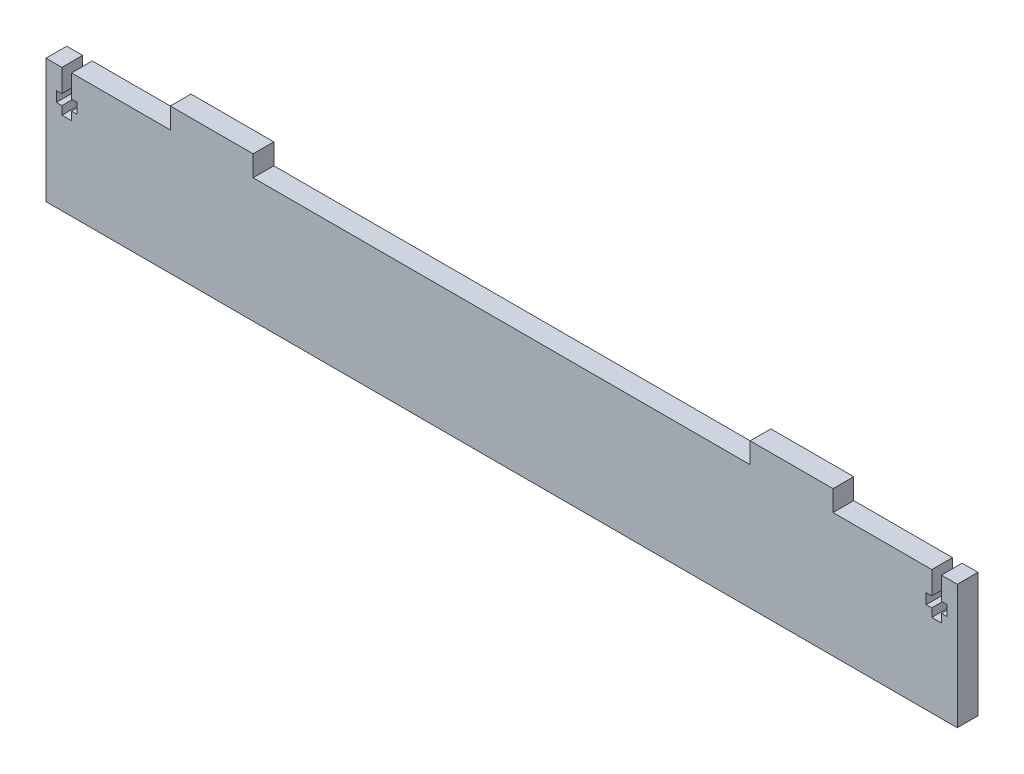
ISO-10303-21;
HEADER;
FILE_DESCRIPTION(('STEP AP214'),'2;1');
FILE_NAME('part.step','',(''),(''),'','','');
FILE_SCHEMA(('AUTOMOTIVE_DESIGN { 1 0 10303 214 1 1 1 1 }'));
ENDSEC;
DATA;
#1=APPLICATION_CONTEXT('core data for automotive mechanical design processes');
#2=APPLICATION_PROTOCOL_DEFINITION('international standard','automotive_design',2000,#1);
#3=PRODUCT_CONTEXT('',#1,'mechanical');
#4=PRODUCT('Part','Part','',(#3));
#5=PRODUCT_RELATED_PRODUCT_CATEGORY('part','',(#4));
#6=PRODUCT_DEFINITION_FORMATION('','',#4);
#7=PRODUCT_DEFINITION_CONTEXT('part definition',#1,'design');
#8=PRODUCT_DEFINITION('design','',#6,#7);
#9=PRODUCT_DEFINITION_SHAPE('','',#8);
#10=(LENGTH_UNIT() NAMED_UNIT(*) SI_UNIT(.MILLI.,.METRE.));
#11=(NAMED_UNIT(*) PLANE_ANGLE_UNIT() SI_UNIT($,.RADIAN.));
#12=(NAMED_UNIT(*) SI_UNIT($,.STERADIAN.) SOLID_ANGLE_UNIT());
#13=UNCERTAINTY_MEASURE_WITH_UNIT(LENGTH_MEASURE(1.E-05),#10,'distance_accuracy_value','');
#14=(GEOMETRIC_REPRESENTATION_CONTEXT(3) GLOBAL_UNCERTAINTY_ASSIGNED_CONTEXT((#13)) GLOBAL_UNIT_ASSIGNED_CONTEXT((#10,
#11,#12)) REPRESENTATION_CONTEXT('',''));
#15=CARTESIAN_POINT('',(0.,0.,0.));
#16=DIRECTION('',(0.,0.,1.));
#17=DIRECTION('',(1.,0.,0.));
#18=AXIS2_PLACEMENT_3D('',#15,#16,#17);
#19=CARTESIAN_POINT('',(101.6,19.05,6.35));
#20=DIRECTION('',(0.,-1.,0.));
#21=DIRECTION('',(1.,0.,0.));
#22=AXIS2_PLACEMENT_3D('',#19,#20,#21);
#23=PLANE('',#22);
#24=DIRECTION('',(-1.,0.,0.));
#25=VECTOR('',#24,1.);
#26=CARTESIAN_POINT('',(101.6,19.05,6.35));
#27=LINE('',#26,#25);
#28=CARTESIAN_POINT('',(131.8768,19.0499999999999,6.35));
#29=VERTEX_POINT('',#28);
#30=CARTESIAN_POINT('',(101.6,19.05,6.35));
#31=VERTEX_POINT('',#30);
#32=EDGE_CURVE('E508',#29,#31,#27,.T.);
#33=ORIENTED_EDGE('',*,*,#32,.F.);
#34=DIRECTION('',(0.,0.,1.));
#35=VECTOR('',#34,1.);
#36=CARTESIAN_POINT('',(131.8768,19.0499999999999,0.));
#37=LINE('',#36,#35);
#38=CARTESIAN_POINT('',(131.8768,19.0499999999999,0.));
#39=VERTEX_POINT('',#38);
#40=EDGE_CURVE('E484',#39,#29,#37,.T.);
#41=ORIENTED_EDGE('',*,*,#40,.F.);
#42=DIRECTION('',(-1.,0.,0.));
#43=VECTOR('',#42,1.);
#44=CARTESIAN_POINT('',(101.6,19.05,0.));
#45=LINE('',#44,#43);
#46=CARTESIAN_POINT('',(101.6,19.05,0.));
#47=VERTEX_POINT('',#46);
#48=EDGE_CURVE('E344',#39,#47,#45,.T.);
#49=ORIENTED_EDGE('',*,*,#48,.T.);
#50=DIRECTION('',(0.,0.,-1.));
#51=VECTOR('',#50,1.);
#52=CARTESIAN_POINT('',(101.6,19.05,6.35));
#53=LINE('',#52,#51);
#54=EDGE_CURVE('E40',#31,#47,#53,.T.);
#55=ORIENTED_EDGE('',*,*,#54,.F.);
#56=EDGE_LOOP('',(#33,#41,#49,#55));
#57=FACE_BOUND('',#56,.T.);
#58=ADVANCED_FACE('F32',(#57),#23,.F.);
#59=CARTESIAN_POINT('',(-139.7,19.05,6.35));
#60=DIRECTION('',(0.,-1.,0.));
#61=DIRECTION('',(0.,0.,-1.));
#62=AXIS2_PLACEMENT_3D('',#59,#60,#61);
#63=PLANE('',#62);
#64=DIRECTION('',(-1.,0.,0.));
#65=VECTOR('',#64,1.);
#66=CARTESIAN_POINT('',(-139.7,19.05,0.));
#67=LINE('',#66,#65);
#68=CARTESIAN_POINT('',(-101.6,19.05,0.));
#69=VERTEX_POINT('',#68);
#70=CARTESIAN_POINT('',(-131.8768,19.05,0.));
#71=VERTEX_POINT('',#70);
#72=EDGE_CURVE('E289',#69,#71,#67,.T.);
#73=ORIENTED_EDGE('',*,*,#72,.T.);
#74=DIRECTION('',(0.,0.,1.));
#75=VECTOR('',#74,1.);
#76=CARTESIAN_POINT('',(-131.8768,19.05,0.));
#77=LINE('',#76,#75);
#78=CARTESIAN_POINT('',(-131.8768,19.05,6.35));
#79=VERTEX_POINT('',#78);
#80=EDGE_CURVE('E379',#71,#79,#77,.T.);
#81=ORIENTED_EDGE('',*,*,#80,.T.);
#82=DIRECTION('',(-1.,0.,0.));
#83=VECTOR('',#82,1.);
#84=CARTESIAN_POINT('',(-139.7,19.05,6.35));
#85=LINE('',#84,#83);
#86=CARTESIAN_POINT('',(-101.6,19.05,6.35));
#87=VERTEX_POINT('',#86);
#88=EDGE_CURVE('E381',#87,#79,#85,.T.);
#89=ORIENTED_EDGE('',*,*,#88,.F.);
#90=DIRECTION('',(0.,0.,-1.));
#91=VECTOR('',#90,1.);
#92=CARTESIAN_POINT('',(-101.6,19.05,6.35));
#93=LINE('',#92,#91);
#94=EDGE_CURVE('E310',#87,#69,#93,.T.);
#95=ORIENTED_EDGE('',*,*,#94,.T.);
#96=EDGE_LOOP('',(#73,#81,#89,#95));
#97=FACE_BOUND('',#96,.T.);
#98=ADVANCED_FACE('F377',(#97),#63,.F.);
#99=CARTESIAN_POINT('',(139.7,19.05,6.35));
#100=DIRECTION('',(-1.,0.,0.));
#101=DIRECTION('',(0.,0.,1.));
#102=AXIS2_PLACEMENT_3D('',#99,#100,#101);
#103=PLANE('',#102);
#104=DIRECTION('',(0.,1.,0.));
#105=VECTOR('',#104,1.);
#106=CARTESIAN_POINT('',(139.7,19.05,0.));
#107=LINE('',#106,#105);
#108=CARTESIAN_POINT('',(139.7,-19.05,0.));
#109=VERTEX_POINT('',#108);
#110=CARTESIAN_POINT('',(139.7,19.05,0.));
#111=VERTEX_POINT('',#110);
#112=EDGE_CURVE('E390',#109,#111,#107,.T.);
#113=ORIENTED_EDGE('',*,*,#112,.T.);
#114=DIRECTION('',(0.,0.,-1.));
#115=VECTOR('',#114,1.);
#116=CARTESIAN_POINT('',(139.7,19.05,6.35));
#117=LINE('',#116,#115);
#118=CARTESIAN_POINT('',(139.7,19.05,6.35));
#119=VERTEX_POINT('',#118);
#120=EDGE_CURVE('E11',#119,#111,#117,.T.);
#121=ORIENTED_EDGE('',*,*,#120,.F.);
#122=DIRECTION('',(0.,1.,0.));
#123=VECTOR('',#122,1.);
#124=CARTESIAN_POINT('',(139.7,19.05,6.35));
#125=LINE('',#124,#123);
#126=CARTESIAN_POINT('',(139.7,-19.05,6.35));
#127=VERTEX_POINT('',#126);
#128=EDGE_CURVE('E300',#127,#119,#125,.T.);
#129=ORIENTED_EDGE('',*,*,#128,.F.);
#130=DIRECTION('',(0.,0.,-1.));
#131=VECTOR('',#130,1.);
#132=CARTESIAN_POINT('',(139.7,-19.05,6.35));
#133=LINE('',#132,#131);
#134=EDGE_CURVE('E301',#127,#109,#133,.T.);
#135=ORIENTED_EDGE('',*,*,#134,.T.);
#136=EDGE_LOOP('',(#113,#121,#129,#135));
#137=FACE_BOUND('',#136,.T.);
#138=ADVANCED_FACE('F34',(#137),#103,.F.);
#139=CARTESIAN_POINT('',(134.8232,19.0499999999999,0.));
#140=VERTEX_POINT('',#139);
#141=EDGE_CURVE('E347',#111,#140,#45,.T.);
#142=ORIENTED_EDGE('',*,*,#141,.T.);
#143=DIRECTION('',(0.,0.,1.));
#144=VECTOR('',#143,1.);
#145=CARTESIAN_POINT('',(134.8232,19.0499999999999,0.));
#146=LINE('',#145,#144);
#147=CARTESIAN_POINT('',(134.8232,19.0499999999999,6.35));
#148=VERTEX_POINT('',#147);
#149=EDGE_CURVE('E486',#140,#148,#146,.T.);
#150=ORIENTED_EDGE('',*,*,#149,.T.);
#151=EDGE_CURVE('E509',#119,#148,#27,.T.);
#152=ORIENTED_EDGE('',*,*,#151,.F.);
#153=ORIENTED_EDGE('',*,*,#120,.T.);
#154=EDGE_LOOP('',(#142,#150,#152,#153));
#155=FACE_BOUND('',#154,.T.);
#156=ADVANCED_FACE('F537',(#155),#23,.F.);
#157=CARTESIAN_POINT('',(101.6,19.05,6.35));
#158=DIRECTION('',(-1.,0.,0.));
#159=DIRECTION('',(0.,0.,1.));
#160=AXIS2_PLACEMENT_3D('',#157,#158,#159);
#161=PLANE('',#160);
#162=DIRECTION('',(0.,1.,0.));
#163=VECTOR('',#162,1.);
#164=CARTESIAN_POINT('',(101.6,19.05,0.));
#165=LINE('',#164,#163);
#166=CARTESIAN_POINT('',(101.6,25.4,0.));
#167=VERTEX_POINT('',#166);
#168=EDGE_CURVE('E337',#47,#167,#165,.T.);
#169=ORIENTED_EDGE('',*,*,#168,.T.);
#170=DIRECTION('',(0.,0.,-1.));
#171=VECTOR('',#170,1.);
#172=CARTESIAN_POINT('',(101.6,25.4,6.35));
#173=LINE('',#172,#171);
#174=CARTESIAN_POINT('',(101.6,25.4,6.35));
#175=VERTEX_POINT('',#174);
#176=EDGE_CURVE('E328',#175,#167,#173,.T.);
#177=ORIENTED_EDGE('',*,*,#176,.F.);
#178=DIRECTION('',(0.,1.,0.));
#179=VECTOR('',#178,1.);
#180=CARTESIAN_POINT('',(101.6,19.05,6.35));
#181=LINE('',#180,#179);
#182=EDGE_CURVE('E338',#31,#175,#181,.T.);
#183=ORIENTED_EDGE('',*,*,#182,.F.);
#184=ORIENTED_EDGE('',*,*,#54,.T.);
#185=EDGE_LOOP('',(#169,#177,#183,#184));
#186=FACE_BOUND('',#185,.T.);
#187=ADVANCED_FACE('F335',(#186),#161,.F.);
#188=CARTESIAN_POINT('',(101.6,25.4,6.35));
#189=DIRECTION('',(0.,-1.,0.));
#190=DIRECTION('',(1.,0.,0.));
#191=AXIS2_PLACEMENT_3D('',#188,#189,#190);
#192=PLANE('',#191);
#193=DIRECTION('',(-1.,0.,0.));
#194=VECTOR('',#193,1.);
#195=CARTESIAN_POINT('',(101.6,25.4,0.));
#196=LINE('',#195,#194);
#197=CARTESIAN_POINT('',(76.2,25.4,0.));
#198=VERTEX_POINT('',#197);
#199=EDGE_CURVE('E346',#167,#198,#196,.T.);
#200=ORIENTED_EDGE('',*,*,#199,.T.);
#201=DIRECTION('',(0.,0.,-1.));
#202=VECTOR('',#201,1.);
#203=CARTESIAN_POINT('',(76.2,25.4,6.35));
#204=LINE('',#203,#202);
#205=CARTESIAN_POINT('',(76.2,25.4,6.35));
#206=VERTEX_POINT('',#205);
#207=EDGE_CURVE('E325',#206,#198,#204,.T.);
#208=ORIENTED_EDGE('',*,*,#207,.F.);
#209=DIRECTION('',(-1.,0.,0.));
#210=VECTOR('',#209,1.);
#211=CARTESIAN_POINT('',(101.6,25.4,6.35));
#212=LINE('',#211,#210);
#213=EDGE_CURVE('E513',#175,#206,#212,.T.);
#214=ORIENTED_EDGE('',*,*,#213,.F.);
#215=ORIENTED_EDGE('',*,*,#176,.T.);
#216=EDGE_LOOP('',(#200,#208,#214,#215));
#217=FACE_BOUND('',#216,.T.);
#218=ADVANCED_FACE('F549',(#217),#192,.F.);
#219=CARTESIAN_POINT('',(76.2,25.4,6.35));
#220=DIRECTION('',(1.,0.,0.));
#221=DIRECTION('',(0.,0.,-1.));
#222=AXIS2_PLACEMENT_3D('',#219,#220,#221);
#223=PLANE('',#222);
#224=DIRECTION('',(0.,-1.,0.));
#225=VECTOR('',#224,1.);
#226=CARTESIAN_POINT('',(76.2,25.4,0.));
#227=LINE('',#226,#225);
#228=CARTESIAN_POINT('',(76.2,19.05,0.));
#229=VERTEX_POINT('',#228);
#230=EDGE_CURVE('E349',#198,#229,#227,.T.);
#231=ORIENTED_EDGE('',*,*,#230,.T.);
#232=DIRECTION('',(0.,0.,-1.));
#233=VECTOR('',#232,1.);
#234=CARTESIAN_POINT('',(76.2,19.05,6.35));
#235=LINE('',#234,#233);
#236=CARTESIAN_POINT('',(76.2,19.05,6.35));
#237=VERTEX_POINT('',#236);
#238=EDGE_CURVE('E322',#237,#229,#235,.T.);
#239=ORIENTED_EDGE('',*,*,#238,.F.);
#240=DIRECTION('',(0.,-1.,0.));
#241=VECTOR('',#240,1.);
#242=CARTESIAN_POINT('',(76.2,25.4,6.35));
#243=LINE('',#242,#241);
#244=EDGE_CURVE('E515',#206,#237,#243,.T.);
#245=ORIENTED_EDGE('',*,*,#244,.F.);
#246=ORIENTED_EDGE('',*,*,#207,.T.);
#247=EDGE_LOOP('',(#231,#239,#245,#246));
#248=FACE_BOUND('',#247,.T.);
#249=ADVANCED_FACE('F728',(#248),#223,.F.);
#250=CARTESIAN_POINT('',(-76.2,19.05,6.35));
#251=DIRECTION('',(0.,-1.,0.));
#252=DIRECTION('',(1.,0.,0.));
#253=AXIS2_PLACEMENT_3D('',#250,#251,#252);
#254=PLANE('',#253);
#255=DIRECTION('',(-1.,0.,0.));
#256=VECTOR('',#255,1.);
#257=CARTESIAN_POINT('',(-76.2,19.05,0.));
#258=LINE('',#257,#256);
#259=CARTESIAN_POINT('',(-76.2,19.05,0.));
#260=VERTEX_POINT('',#259);
#261=EDGE_CURVE('E356',#229,#260,#258,.T.);
#262=ORIENTED_EDGE('',*,*,#261,.T.);
#263=DIRECTION('',(0.,0.,-1.));
#264=VECTOR('',#263,1.);
#265=CARTESIAN_POINT('',(-76.2,19.05,6.35));
#266=LINE('',#265,#264);
#267=CARTESIAN_POINT('',(-76.2,19.05,6.35));
#268=VERTEX_POINT('',#267);
#269=EDGE_CURVE('E319',#268,#260,#266,.T.);
#270=ORIENTED_EDGE('',*,*,#269,.F.);
#271=DIRECTION('',(-1.,0.,0.));
#272=VECTOR('',#271,1.);
#273=CARTESIAN_POINT('',(-76.2,19.05,6.35));
#274=LINE('',#273,#272);
#275=EDGE_CURVE('E517',#237,#268,#274,.T.);
#276=ORIENTED_EDGE('',*,*,#275,.F.);
#277=ORIENTED_EDGE('',*,*,#238,.T.);
#278=EDGE_LOOP('',(#262,#270,#276,#277));
#279=FACE_BOUND('',#278,.T.);
#280=ADVANCED_FACE('F733',(#279),#254,.F.);
#281=CARTESIAN_POINT('',(-76.2,25.4,6.35));
#282=DIRECTION('',(-1.,0.,0.));
#283=DIRECTION('',(0.,0.,1.));
#284=AXIS2_PLACEMENT_3D('',#281,#282,#283);
#285=PLANE('',#284);
#286=DIRECTION('',(0.,1.,0.));
#287=VECTOR('',#286,1.);
#288=CARTESIAN_POINT('',(-76.2,25.4,0.));
#289=LINE('',#288,#287);
#290=CARTESIAN_POINT('',(-76.2,25.4,0.));
#291=VERTEX_POINT('',#290);
#292=EDGE_CURVE('E358',#260,#291,#289,.T.);
#293=ORIENTED_EDGE('',*,*,#292,.T.);
#294=DIRECTION('',(0.,0.,-1.));
#295=VECTOR('',#294,1.);
#296=CARTESIAN_POINT('',(-76.2,25.4,6.35));
#297=LINE('',#296,#295);
#298=CARTESIAN_POINT('',(-76.2,25.4,6.35));
#299=VERTEX_POINT('',#298);
#300=EDGE_CURVE('E316',#299,#291,#297,.T.);
#301=ORIENTED_EDGE('',*,*,#300,.F.);
#302=DIRECTION('',(0.,1.,0.));
#303=VECTOR('',#302,1.);
#304=CARTESIAN_POINT('',(-76.2,25.4,6.35));
#305=LINE('',#304,#303);
#306=EDGE_CURVE('E519',#268,#299,#305,.T.);
#307=ORIENTED_EDGE('',*,*,#306,.F.);
#308=ORIENTED_EDGE('',*,*,#269,.T.);
#309=EDGE_LOOP('',(#293,#301,#307,#308));
#310=FACE_BOUND('',#309,.T.);
#311=ADVANCED_FACE('F736',(#310),#285,.F.);
#312=CARTESIAN_POINT('',(-101.6,25.4,6.35));
#313=DIRECTION('',(0.,-1.,0.));
#314=DIRECTION('',(1.,0.,0.));
#315=AXIS2_PLACEMENT_3D('',#312,#313,#314);
#316=PLANE('',#315);
#317=DIRECTION('',(-1.,0.,0.));
#318=VECTOR('',#317,1.);
#319=CARTESIAN_POINT('',(-101.6,25.4,0.));
#320=LINE('',#319,#318);
#321=CARTESIAN_POINT('',(-101.6,25.4,0.));
#322=VERTEX_POINT('',#321);
#323=EDGE_CURVE('E293',#291,#322,#320,.T.);
#324=ORIENTED_EDGE('',*,*,#323,.T.);
#325=DIRECTION('',(0.,0.,-1.));
#326=VECTOR('',#325,1.);
#327=CARTESIAN_POINT('',(-101.6,25.4,6.35));
#328=LINE('',#327,#326);
#329=CARTESIAN_POINT('',(-101.6,25.4,6.35));
#330=VERTEX_POINT('',#329);
#331=EDGE_CURVE('E313',#330,#322,#328,.T.);
#332=ORIENTED_EDGE('',*,*,#331,.F.);
#333=DIRECTION('',(-1.,0.,0.));
#334=VECTOR('',#333,1.);
#335=CARTESIAN_POINT('',(-101.6,25.4,6.35));
#336=LINE('',#335,#334);
#337=EDGE_CURVE('E520',#299,#330,#336,.T.);
#338=ORIENTED_EDGE('',*,*,#337,.F.);
#339=ORIENTED_EDGE('',*,*,#300,.T.);
#340=EDGE_LOOP('',(#324,#332,#338,#339));
#341=FACE_BOUND('',#340,.T.);
#342=ADVANCED_FACE('F362',(#341),#316,.F.);
#343=CARTESIAN_POINT('',(-101.6,19.05,6.35));
#344=DIRECTION('',(1.,0.,0.));
#345=DIRECTION('',(0.,0.,-1.));
#346=AXIS2_PLACEMENT_3D('',#343,#344,#345);
#347=PLANE('',#346);
#348=DIRECTION('',(0.,-1.,0.));
#349=VECTOR('',#348,1.);
#350=CARTESIAN_POINT('',(-101.6,19.05,0.));
#351=LINE('',#350,#349);
#352=EDGE_CURVE('E290',#322,#69,#351,.T.);
#353=ORIENTED_EDGE('',*,*,#352,.T.);
#354=ORIENTED_EDGE('',*,*,#94,.F.);
#355=DIRECTION('',(0.,-1.,0.));
#356=VECTOR('',#355,1.);
#357=CARTESIAN_POINT('',(-101.6,19.05,6.35));
#358=LINE('',#357,#356);
#359=EDGE_CURVE('E371',#330,#87,#358,.T.);
#360=ORIENTED_EDGE('',*,*,#359,.F.);
#361=ORIENTED_EDGE('',*,*,#331,.T.);
#362=EDGE_LOOP('',(#353,#354,#360,#361));
#363=FACE_BOUND('',#362,.T.);
#364=ADVANCED_FACE('F369',(#363),#347,.F.);
#365=CARTESIAN_POINT('',(-134.8232,19.05,6.35));
#366=VERTEX_POINT('',#365);
#367=CARTESIAN_POINT('',(-139.7,19.05,6.35));
#368=VERTEX_POINT('',#367);
#369=EDGE_CURVE('E281',#366,#368,#85,.T.);
#370=ORIENTED_EDGE('',*,*,#369,.F.);
#371=DIRECTION('',(0.,0.,1.));
#372=VECTOR('',#371,1.);
#373=CARTESIAN_POINT('',(-134.8232,19.05,0.));
#374=LINE('',#373,#372);
#375=CARTESIAN_POINT('',(-134.8232,19.05,0.));
#376=VERTEX_POINT('',#375);
#377=EDGE_CURVE('E268',#376,#366,#374,.T.);
#378=ORIENTED_EDGE('',*,*,#377,.F.);
#379=CARTESIAN_POINT('',(-139.7,19.05,0.));
#380=VERTEX_POINT('',#379);
#381=EDGE_CURVE('E279',#376,#380,#67,.T.);
#382=ORIENTED_EDGE('',*,*,#381,.T.);
#383=DIRECTION('',(0.,0.,-1.));
#384=VECTOR('',#383,1.);
#385=CARTESIAN_POINT('',(-139.7,19.05,6.35));
#386=LINE('',#385,#384);
#387=EDGE_CURVE('E308',#368,#380,#386,.T.);
#388=ORIENTED_EDGE('',*,*,#387,.F.);
#389=EDGE_LOOP('',(#370,#378,#382,#388));
#390=FACE_BOUND('',#389,.T.);
#391=ADVANCED_FACE('F277',(#390),#63,.F.);
#392=CARTESIAN_POINT('',(-139.7,19.05,6.35));
#393=DIRECTION('',(1.,0.,0.));
#394=DIRECTION('',(0.,0.,-1.));
#395=AXIS2_PLACEMENT_3D('',#392,#393,#394);
#396=PLANE('',#395);
#397=DIRECTION('',(0.,-1.,0.));
#398=VECTOR('',#397,1.);
#399=CARTESIAN_POINT('',(-139.7,19.05,0.));
#400=LINE('',#399,#398);
#401=CARTESIAN_POINT('',(-139.7,-19.05,0.));
#402=VERTEX_POINT('',#401);
#403=EDGE_CURVE('E288',#380,#402,#400,.T.);
#404=ORIENTED_EDGE('',*,*,#403,.T.);
#405=DIRECTION('',(0.,0.,-1.));
#406=VECTOR('',#405,1.);
#407=CARTESIAN_POINT('',(-139.7,-19.05,6.35));
#408=LINE('',#407,#406);
#409=CARTESIAN_POINT('',(-139.7,-19.05,6.35));
#410=VERTEX_POINT('',#409);
#411=EDGE_CURVE('E304',#410,#402,#408,.T.);
#412=ORIENTED_EDGE('',*,*,#411,.F.);
#413=DIRECTION('',(0.,-1.,0.));
#414=VECTOR('',#413,1.);
#415=CARTESIAN_POINT('',(-139.7,19.05,6.35));
#416=LINE('',#415,#414);
#417=EDGE_CURVE('E384',#368,#410,#416,.T.);
#418=ORIENTED_EDGE('',*,*,#417,.F.);
#419=ORIENTED_EDGE('',*,*,#387,.T.);
#420=EDGE_LOOP('',(#404,#412,#418,#419));
#421=FACE_BOUND('',#420,.T.);
#422=ADVANCED_FACE('F532',(#421),#396,.F.);
#423=CARTESIAN_POINT('',(-139.7,-19.05,6.35));
#424=DIRECTION('',(0.,1.,0.));
#425=DIRECTION('',(0.,0.,1.));
#426=AXIS2_PLACEMENT_3D('',#423,#424,#425);
#427=PLANE('',#426);
#428=DIRECTION('',(1.,0.,0.));
#429=VECTOR('',#428,1.);
#430=CARTESIAN_POINT('',(-139.7,-19.05,0.));
#431=LINE('',#430,#429);
#432=EDGE_CURVE('E298',#402,#109,#431,.T.);
#433=ORIENTED_EDGE('',*,*,#432,.T.);
#434=ORIENTED_EDGE('',*,*,#134,.F.);
#435=DIRECTION('',(1.,0.,0.));
#436=VECTOR('',#435,1.);
#437=CARTESIAN_POINT('',(-139.7,-19.05,6.35));
#438=LINE('',#437,#436);
#439=EDGE_CURVE('E305',#410,#127,#438,.T.);
#440=ORIENTED_EDGE('',*,*,#439,.F.);
#441=ORIENTED_EDGE('',*,*,#411,.T.);
#442=EDGE_LOOP('',(#433,#434,#440,#441));
#443=FACE_BOUND('',#442,.T.);
#444=ADVANCED_FACE('F524',(#443),#427,.F.);
#445=CARTESIAN_POINT('',(0.,0.,6.35));
#446=DIRECTION('',(0.,0.,1.));
#447=DIRECTION('',(1.,0.,0.));
#448=AXIS2_PLACEMENT_3D('',#445,#446,#447);
#449=PLANE('',#448);
#450=DIRECTION('',(0.,1.,0.));
#451=VECTOR('',#450,1.);
#452=CARTESIAN_POINT('',(-131.8768,12.065,6.35));
#453=LINE('',#452,#451);
#454=CARTESIAN_POINT('',(-131.8768,12.065,6.35));
#455=VERTEX_POINT('',#454);
#456=EDGE_CURVE('E273',#455,#79,#453,.T.);
#457=ORIENTED_EDGE('',*,*,#456,.F.);
#458=DIRECTION('',(-1.,0.,0.));
#459=VECTOR('',#458,1.);
#460=CARTESIAN_POINT('',(-130.175,12.065,6.35));
#461=LINE('',#460,#459);
#462=CARTESIAN_POINT('',(-130.175,12.065,6.35));
#463=VERTEX_POINT('',#462);
#464=EDGE_CURVE('E592',#463,#455,#461,.T.);
#465=ORIENTED_EDGE('',*,*,#464,.F.);
#466=DIRECTION('',(0.,1.,0.));
#467=VECTOR('',#466,1.);
#468=CARTESIAN_POINT('',(-130.175,8.89000000000001,6.35));
#469=LINE('',#468,#467);
#470=CARTESIAN_POINT('',(-130.175,8.89000000000001,6.35));
#471=VERTEX_POINT('',#470);
#472=EDGE_CURVE('E590',#471,#463,#469,.T.);
#473=ORIENTED_EDGE('',*,*,#472,.F.);
#474=DIRECTION('',(1.,0.,0.));
#475=VECTOR('',#474,1.);
#476=CARTESIAN_POINT('',(-131.8768,8.89000000000001,6.35));
#477=LINE('',#476,#475);
#478=CARTESIAN_POINT('',(-131.8768,8.89000000000001,6.35));
#479=VERTEX_POINT('',#478);
#480=EDGE_CURVE('E587',#479,#471,#477,.T.);
#481=ORIENTED_EDGE('',*,*,#480,.F.);
#482=DIRECTION('',(0.,1.,0.));
#483=VECTOR('',#482,1.);
#484=CARTESIAN_POINT('',(-131.8768,6.35,6.35));
#485=LINE('',#484,#483);
#486=CARTESIAN_POINT('',(-131.8768,6.35,6.35));
#487=VERTEX_POINT('',#486);
#488=EDGE_CURVE('E584',#487,#479,#485,.T.);
#489=ORIENTED_EDGE('',*,*,#488,.F.);
#490=DIRECTION('',(1.,0.,0.));
#491=VECTOR('',#490,1.);
#492=CARTESIAN_POINT('',(-134.8232,6.35,6.35));
#493=LINE('',#492,#491);
#494=CARTESIAN_POINT('',(-134.8232,6.35,6.35));
#495=VERTEX_POINT('',#494);
#496=EDGE_CURVE('E581',#495,#487,#493,.T.);
#497=ORIENTED_EDGE('',*,*,#496,.F.);
#498=DIRECTION('',(0.,-1.,0.));
#499=VECTOR('',#498,1.);
#500=CARTESIAN_POINT('',(-134.8232,8.89000000000001,6.35));
#501=LINE('',#500,#499);
#502=CARTESIAN_POINT('',(-134.8232,8.89000000000001,6.35));
#503=VERTEX_POINT('',#502);
#504=EDGE_CURVE('E578',#503,#495,#501,.T.);
#505=ORIENTED_EDGE('',*,*,#504,.F.);
#506=DIRECTION('',(1.,0.,0.));
#507=VECTOR('',#506,1.);
#508=CARTESIAN_POINT('',(-136.525,8.89000000000001,6.35));
#509=LINE('',#508,#507);
#510=CARTESIAN_POINT('',(-136.525,8.89000000000001,6.35));
#511=VERTEX_POINT('',#510);
#512=EDGE_CURVE('E575',#511,#503,#509,.T.);
#513=ORIENTED_EDGE('',*,*,#512,.F.);
#514=DIRECTION('',(0.,-1.,0.));
#515=VECTOR('',#514,1.);
#516=CARTESIAN_POINT('',(-136.525,12.065,6.35));
#517=LINE('',#516,#515);
#518=CARTESIAN_POINT('',(-136.525,12.065,6.35));
#519=VERTEX_POINT('',#518);
#520=EDGE_CURVE('E568',#519,#511,#517,.T.);
#521=ORIENTED_EDGE('',*,*,#520,.F.);
#522=DIRECTION('',(-1.,0.,0.));
#523=VECTOR('',#522,1.);
#524=CARTESIAN_POINT('',(-134.8232,12.065,6.35));
#525=LINE('',#524,#523);
#526=CARTESIAN_POINT('',(-134.8232,12.065,6.35));
#527=VERTEX_POINT('',#526);
#528=EDGE_CURVE('E566',#527,#519,#525,.T.);
#529=ORIENTED_EDGE('',*,*,#528,.F.);
#530=DIRECTION('',(0.,-1.,0.));
#531=VECTOR('',#530,1.);
#532=CARTESIAN_POINT('',(-134.8232,19.05,6.35));
#533=LINE('',#532,#531);
#534=EDGE_CURVE('E483',#366,#527,#533,.T.);
#535=ORIENTED_EDGE('',*,*,#534,.F.);
#536=ORIENTED_EDGE('',*,*,#369,.T.);
#537=ORIENTED_EDGE('',*,*,#417,.T.);
#538=ORIENTED_EDGE('',*,*,#439,.T.);
#539=ORIENTED_EDGE('',*,*,#128,.T.);
#540=ORIENTED_EDGE('',*,*,#151,.T.);
#541=DIRECTION('',(0.,1.,0.));
#542=VECTOR('',#541,1.);
#543=CARTESIAN_POINT('',(134.8232,19.0499999999999,6.35));
#544=LINE('',#543,#542);
#545=CARTESIAN_POINT('',(134.8232,12.0649999999999,6.35));
#546=VERTEX_POINT('',#545);
#547=EDGE_CURVE('E477',#546,#148,#544,.T.);
#548=ORIENTED_EDGE('',*,*,#547,.F.);
#549=DIRECTION('',(-1.,0.,0.));
#550=VECTOR('',#549,1.);
#551=CARTESIAN_POINT('',(134.8232,12.0649999999999,6.35));
#552=LINE('',#551,#550);
#553=CARTESIAN_POINT('',(136.525,12.0649999999999,6.35));
#554=VERTEX_POINT('',#553);
#555=EDGE_CURVE('E474',#554,#546,#552,.T.);
#556=ORIENTED_EDGE('',*,*,#555,.F.);
#557=DIRECTION('',(0.,1.,0.));
#558=VECTOR('',#557,1.);
#559=CARTESIAN_POINT('',(136.525,12.0649999999999,6.35));
#560=LINE('',#559,#558);
#561=CARTESIAN_POINT('',(136.525,8.88999999999989,6.35));
#562=VERTEX_POINT('',#561);
#563=EDGE_CURVE('E471',#562,#554,#560,.T.);
#564=ORIENTED_EDGE('',*,*,#563,.F.);
#565=DIRECTION('',(1.,0.,0.));
#566=VECTOR('',#565,1.);
#567=CARTESIAN_POINT('',(136.525,8.88999999999989,6.35));
#568=LINE('',#567,#566);
#569=CARTESIAN_POINT('',(134.8232,8.88999999999989,6.35));
#570=VERTEX_POINT('',#569);
#571=EDGE_CURVE('E468',#570,#562,#568,.T.);
#572=ORIENTED_EDGE('',*,*,#571,.F.);
#573=DIRECTION('',(0.,1.,0.));
#574=VECTOR('',#573,1.);
#575=CARTESIAN_POINT('',(134.8232,8.88999999999989,6.35));
#576=LINE('',#575,#574);
#577=CARTESIAN_POINT('',(134.8232,6.34999999999989,6.35));
#578=VERTEX_POINT('',#577);
#579=EDGE_CURVE('E465',#578,#570,#576,.T.);
#580=ORIENTED_EDGE('',*,*,#579,.F.);
#581=DIRECTION('',(1.,0.,0.));
#582=VECTOR('',#581,1.);
#583=CARTESIAN_POINT('',(134.8232,6.34999999999989,6.35));
#584=LINE('',#583,#582);
#585=CARTESIAN_POINT('',(131.8768,6.34999999999989,6.35));
#586=VERTEX_POINT('',#585);
#587=EDGE_CURVE('E462',#586,#578,#584,.T.);
#588=ORIENTED_EDGE('',*,*,#587,.F.);
#589=DIRECTION('',(0.,-1.,0.));
#590=VECTOR('',#589,1.);
#591=CARTESIAN_POINT('',(131.8768,6.34999999999989,6.35));
#592=LINE('',#591,#590);
#593=CARTESIAN_POINT('',(131.8768,8.88999999999989,6.35));
#594=VERTEX_POINT('',#593);
#595=EDGE_CURVE('E459',#594,#586,#592,.T.);
#596=ORIENTED_EDGE('',*,*,#595,.F.);
#597=DIRECTION('',(1.,0.,0.));
#598=VECTOR('',#597,1.);
#599=CARTESIAN_POINT('',(131.8768,8.88999999999989,6.35));
#600=LINE('',#599,#598);
#601=CARTESIAN_POINT('',(130.175,8.88999999999989,6.35));
#602=VERTEX_POINT('',#601);
#603=EDGE_CURVE('E456',#602,#594,#600,.T.);
#604=ORIENTED_EDGE('',*,*,#603,.F.);
#605=DIRECTION('',(0.,-1.,0.));
#606=VECTOR('',#605,1.);
#607=CARTESIAN_POINT('',(130.175,8.88999999999989,6.35));
#608=LINE('',#607,#606);
#609=CARTESIAN_POINT('',(130.175,12.0649999999999,6.35));
#610=VERTEX_POINT('',#609);
#611=EDGE_CURVE('E453',#610,#602,#608,.T.);
#612=ORIENTED_EDGE('',*,*,#611,.F.);
#613=DIRECTION('',(-1.,0.,0.));
#614=VECTOR('',#613,1.);
#615=CARTESIAN_POINT('',(130.175,12.0649999999999,6.35));
#616=LINE('',#615,#614);
#617=CARTESIAN_POINT('',(131.8768,12.0649999999999,6.35));
#618=VERTEX_POINT('',#617);
#619=EDGE_CURVE('E450',#618,#610,#616,.T.);
#620=ORIENTED_EDGE('',*,*,#619,.F.);
#621=DIRECTION('',(0.,-1.,0.));
#622=VECTOR('',#621,1.);
#623=CARTESIAN_POINT('',(131.8768,12.0649999999999,6.35));
#624=LINE('',#623,#622);
#625=EDGE_CURVE('E422',#29,#618,#624,.T.);
#626=ORIENTED_EDGE('',*,*,#625,.F.);
#627=ORIENTED_EDGE('',*,*,#32,.T.);
#628=ORIENTED_EDGE('',*,*,#182,.T.);
#629=ORIENTED_EDGE('',*,*,#213,.T.);
#630=ORIENTED_EDGE('',*,*,#244,.T.);
#631=ORIENTED_EDGE('',*,*,#275,.T.);
#632=ORIENTED_EDGE('',*,*,#306,.T.);
#633=ORIENTED_EDGE('',*,*,#337,.T.);
#634=ORIENTED_EDGE('',*,*,#359,.T.);
#635=ORIENTED_EDGE('',*,*,#88,.T.);
#636=EDGE_LOOP('',(#457,#465,#473,#481,#489,#497,#505,#513,#521,#529,#535,#536,#537,#538,#539,
#540,#548,#556,#564,#572,#580,#588,#596,#604,#612,#620,#626,#627,#628,#629,#630,#631,#632,#633,
#634,#635));
#637=FACE_BOUND('',#636,.T.);
#638=ADVANCED_FACE('F521',(#637),#449,.T.);
#639=CARTESIAN_POINT('',(0.,0.,0.));
#640=DIRECTION('',(0.,0.,1.));
#641=DIRECTION('',(1.,0.,0.));
#642=AXIS2_PLACEMENT_3D('',#639,#640,#641);
#643=PLANE('',#642);
#644=DIRECTION('',(-1.,0.,0.));
#645=VECTOR('',#644,1.);
#646=CARTESIAN_POINT('',(-130.175,12.065,0.));
#647=LINE('',#646,#645);
#648=CARTESIAN_POINT('',(-130.175,12.065,0.));
#649=VERTEX_POINT('',#648);
#650=CARTESIAN_POINT('',(-131.8768,12.065,0.));
#651=VERTEX_POINT('',#650);
#652=EDGE_CURVE('E599',#649,#651,#647,.T.);
#653=ORIENTED_EDGE('',*,*,#652,.T.);
#654=DIRECTION('',(0.,1.,0.));
#655=VECTOR('',#654,1.);
#656=CARTESIAN_POINT('',(-131.8768,12.065,0.));
#657=LINE('',#656,#655);
#658=EDGE_CURVE('E282',#651,#71,#657,.T.);
#659=ORIENTED_EDGE('',*,*,#658,.T.);
#660=ORIENTED_EDGE('',*,*,#72,.F.);
#661=ORIENTED_EDGE('',*,*,#352,.F.);
#662=ORIENTED_EDGE('',*,*,#323,.F.);
#663=ORIENTED_EDGE('',*,*,#292,.F.);
#664=ORIENTED_EDGE('',*,*,#261,.F.);
#665=ORIENTED_EDGE('',*,*,#230,.F.);
#666=ORIENTED_EDGE('',*,*,#199,.F.);
#667=ORIENTED_EDGE('',*,*,#168,.F.);
#668=ORIENTED_EDGE('',*,*,#48,.F.);
#669=DIRECTION('',(0.,-1.,0.));
#670=VECTOR('',#669,1.);
#671=CARTESIAN_POINT('',(131.8768,12.0649999999999,0.));
#672=LINE('',#671,#670);
#673=CARTESIAN_POINT('',(131.8768,12.0649999999999,0.));
#674=VERTEX_POINT('',#673);
#675=EDGE_CURVE('E447',#39,#674,#672,.T.);
#676=ORIENTED_EDGE('',*,*,#675,.T.);
#677=DIRECTION('',(-1.,0.,0.));
#678=VECTOR('',#677,1.);
#679=CARTESIAN_POINT('',(130.175,12.0649999999999,0.));
#680=LINE('',#679,#678);
#681=CARTESIAN_POINT('',(130.175,12.0649999999999,0.));
#682=VERTEX_POINT('',#681);
#683=EDGE_CURVE('E418',#674,#682,#680,.T.);
#684=ORIENTED_EDGE('',*,*,#683,.T.);
#685=DIRECTION('',(0.,-1.,0.));
#686=VECTOR('',#685,1.);
#687=CARTESIAN_POINT('',(130.175,8.88999999999989,0.));
#688=LINE('',#687,#686);
#689=CARTESIAN_POINT('',(130.175,8.88999999999989,0.));
#690=VERTEX_POINT('',#689);
#691=EDGE_CURVE('E421',#682,#690,#688,.T.);
#692=ORIENTED_EDGE('',*,*,#691,.T.);
#693=DIRECTION('',(1.,0.,0.));
#694=VECTOR('',#693,1.);
#695=CARTESIAN_POINT('',(131.8768,8.88999999999989,0.));
#696=LINE('',#695,#694);
#697=CARTESIAN_POINT('',(131.8768,8.88999999999989,0.));
#698=VERTEX_POINT('',#697);
#699=EDGE_CURVE('E55',#690,#698,#696,.T.);
#700=ORIENTED_EDGE('',*,*,#699,.T.);
#701=DIRECTION('',(0.,-1.,0.));
#702=VECTOR('',#701,1.);
#703=CARTESIAN_POINT('',(131.8768,6.34999999999989,0.));
#704=LINE('',#703,#702);
#705=CARTESIAN_POINT('',(131.8768,6.34999999999989,0.));
#706=VERTEX_POINT('',#705);
#707=EDGE_CURVE('E426',#698,#706,#704,.T.);
#708=ORIENTED_EDGE('',*,*,#707,.T.);
#709=DIRECTION('',(1.,0.,0.));
#710=VECTOR('',#709,1.);
#711=CARTESIAN_POINT('',(134.8232,6.34999999999989,0.));
#712=LINE('',#711,#710);
#713=CARTESIAN_POINT('',(134.8232,6.34999999999989,0.));
#714=VERTEX_POINT('',#713);
#715=EDGE_CURVE('E429',#706,#714,#712,.T.);
#716=ORIENTED_EDGE('',*,*,#715,.T.);
#717=DIRECTION('',(0.,1.,0.));
#718=VECTOR('',#717,1.);
#719=CARTESIAN_POINT('',(134.8232,8.88999999999989,0.));
#720=LINE('',#719,#718);
#721=CARTESIAN_POINT('',(134.8232,8.88999999999989,0.));
#722=VERTEX_POINT('',#721);
#723=EDGE_CURVE('E432',#714,#722,#720,.T.);
#724=ORIENTED_EDGE('',*,*,#723,.T.);
#725=DIRECTION('',(1.,0.,0.));
#726=VECTOR('',#725,1.);
#727=CARTESIAN_POINT('',(136.525,8.88999999999989,0.));
#728=LINE('',#727,#726);
#729=CARTESIAN_POINT('',(136.525,8.88999999999989,0.));
#730=VERTEX_POINT('',#729);
#731=EDGE_CURVE('E435',#722,#730,#728,.T.);
#732=ORIENTED_EDGE('',*,*,#731,.T.);
#733=DIRECTION('',(0.,1.,0.));
#734=VECTOR('',#733,1.);
#735=CARTESIAN_POINT('',(136.525,12.0649999999999,0.));
#736=LINE('',#735,#734);
#737=CARTESIAN_POINT('',(136.525,12.0649999999999,0.));
#738=VERTEX_POINT('',#737);
#739=EDGE_CURVE('E438',#730,#738,#736,.T.);
#740=ORIENTED_EDGE('',*,*,#739,.T.);
#741=DIRECTION('',(-1.,0.,0.));
#742=VECTOR('',#741,1.);
#743=CARTESIAN_POINT('',(134.8232,12.0649999999999,0.));
#744=LINE('',#743,#742);
#745=CARTESIAN_POINT('',(134.8232,12.0649999999999,0.));
#746=VERTEX_POINT('',#745);
#747=EDGE_CURVE('E441',#738,#746,#744,.T.);
#748=ORIENTED_EDGE('',*,*,#747,.T.);
#749=DIRECTION('',(0.,1.,0.));
#750=VECTOR('',#749,1.);
#751=CARTESIAN_POINT('',(134.8232,19.0499999999999,0.));
#752=LINE('',#751,#750);
#753=EDGE_CURVE('E444',#746,#140,#752,.T.);
#754=ORIENTED_EDGE('',*,*,#753,.T.);
#755=ORIENTED_EDGE('',*,*,#141,.F.);
#756=ORIENTED_EDGE('',*,*,#112,.F.);
#757=ORIENTED_EDGE('',*,*,#432,.F.);
#758=ORIENTED_EDGE('',*,*,#403,.F.);
#759=ORIENTED_EDGE('',*,*,#381,.F.);
#760=DIRECTION('',(0.,-1.,0.));
#761=VECTOR('',#760,1.);
#762=CARTESIAN_POINT('',(-134.8232,19.05,0.));
#763=LINE('',#762,#761);
#764=CARTESIAN_POINT('',(-134.8232,12.065,0.));
#765=VERTEX_POINT('',#764);
#766=EDGE_CURVE('E264',#376,#765,#763,.T.);
#767=ORIENTED_EDGE('',*,*,#766,.T.);
#768=DIRECTION('',(-1.,0.,0.));
#769=VECTOR('',#768,1.);
#770=CARTESIAN_POINT('',(-134.8232,12.065,0.));
#771=LINE('',#770,#769);
#772=CARTESIAN_POINT('',(-136.525,12.065,0.));
#773=VERTEX_POINT('',#772);
#774=EDGE_CURVE('E47',#765,#773,#771,.T.);
#775=ORIENTED_EDGE('',*,*,#774,.T.);
#776=DIRECTION('',(0.,-1.,0.));
#777=VECTOR('',#776,1.);
#778=CARTESIAN_POINT('',(-136.525,12.065,0.));
#779=LINE('',#778,#777);
#780=CARTESIAN_POINT('',(-136.525,8.89000000000001,0.));
#781=VERTEX_POINT('',#780);
#782=EDGE_CURVE('E622',#773,#781,#779,.T.);
#783=ORIENTED_EDGE('',*,*,#782,.T.);
#784=DIRECTION('',(1.,0.,0.));
#785=VECTOR('',#784,1.);
#786=CARTESIAN_POINT('',(-136.525,8.89000000000001,0.));
#787=LINE('',#786,#785);
#788=CARTESIAN_POINT('',(-134.8232,8.89000000000001,0.));
#789=VERTEX_POINT('',#788);
#790=EDGE_CURVE('E619',#781,#789,#787,.T.);
#791=ORIENTED_EDGE('',*,*,#790,.T.);
#792=DIRECTION('',(0.,-1.,0.));
#793=VECTOR('',#792,1.);
#794=CARTESIAN_POINT('',(-134.8232,8.89000000000001,0.));
#795=LINE('',#794,#793);
#796=CARTESIAN_POINT('',(-134.8232,6.35,0.));
#797=VERTEX_POINT('',#796);
#798=EDGE_CURVE('E616',#789,#797,#795,.T.);
#799=ORIENTED_EDGE('',*,*,#798,.T.);
#800=DIRECTION('',(1.,0.,0.));
#801=VECTOR('',#800,1.);
#802=CARTESIAN_POINT('',(-134.8232,6.35,0.));
#803=LINE('',#802,#801);
#804=CARTESIAN_POINT('',(-131.8768,6.35,0.));
#805=VERTEX_POINT('',#804);
#806=EDGE_CURVE('E613',#797,#805,#803,.T.);
#807=ORIENTED_EDGE('',*,*,#806,.T.);
#808=DIRECTION('',(0.,1.,0.));
#809=VECTOR('',#808,1.);
#810=CARTESIAN_POINT('',(-131.8768,6.35,0.));
#811=LINE('',#810,#809);
#812=CARTESIAN_POINT('',(-131.8768,8.89000000000001,0.));
#813=VERTEX_POINT('',#812);
#814=EDGE_CURVE('E609',#805,#813,#811,.T.);
#815=ORIENTED_EDGE('',*,*,#814,.T.);
#816=DIRECTION('',(1.,0.,0.));
#817=VECTOR('',#816,1.);
#818=CARTESIAN_POINT('',(-131.8768,8.89000000000001,0.));
#819=LINE('',#818,#817);
#820=CARTESIAN_POINT('',(-130.175,8.89000000000001,0.));
#821=VERTEX_POINT('',#820);
#822=EDGE_CURVE('E606',#813,#821,#819,.T.);
#823=ORIENTED_EDGE('',*,*,#822,.T.);
#824=DIRECTION('',(0.,1.,0.));
#825=VECTOR('',#824,1.);
#826=CARTESIAN_POINT('',(-130.175,8.89000000000001,0.));
#827=LINE('',#826,#825);
#828=EDGE_CURVE('E601',#821,#649,#827,.T.);
#829=ORIENTED_EDGE('',*,*,#828,.T.);
#830=EDGE_LOOP('',(#653,#659,#660,#661,#662,#663,#664,#665,#666,#667,#668,#676,#684,#692,#700,
#708,#716,#724,#732,#740,#748,#754,#755,#756,#757,#758,#759,#767,#775,#783,#791,#799,#807,#815,
#823,#829));
#831=FACE_BOUND('',#830,.T.);
#832=ADVANCED_FACE('F286',(#831),#643,.F.);
#833=CARTESIAN_POINT('',(130.175,12.0649999999999,0.));
#834=DIRECTION('',(0.,1.,0.));
#835=DIRECTION('',(0.,0.,1.));
#836=AXIS2_PLACEMENT_3D('',#833,#834,#835);
#837=PLANE('',#836);
#838=ORIENTED_EDGE('',*,*,#619,.T.);
#839=DIRECTION('',(0.,0.,1.));
#840=VECTOR('',#839,1.);
#841=CARTESIAN_POINT('',(130.175,12.0649999999999,0.));
#842=LINE('',#841,#840);
#843=EDGE_CURVE('E449',#682,#610,#842,.T.);
#844=ORIENTED_EDGE('',*,*,#843,.F.);
#845=ORIENTED_EDGE('',*,*,#683,.F.);
#846=DIRECTION('',(0.,0.,1.));
#847=VECTOR('',#846,1.);
#848=CARTESIAN_POINT('',(131.8768,12.0649999999999,0.));
#849=LINE('',#848,#847);
#850=EDGE_CURVE('E481',#674,#618,#849,.T.);
#851=ORIENTED_EDGE('',*,*,#850,.T.);
#852=EDGE_LOOP('',(#838,#844,#845,#851));
#853=FACE_BOUND('',#852,.T.);
#854=ADVANCED_FACE('F530',(#853),#837,.F.);
#855=CARTESIAN_POINT('',(131.8768,12.0649999999999,0.));
#856=DIRECTION('',(-1.,0.,0.));
#857=DIRECTION('',(0.,0.,1.));
#858=AXIS2_PLACEMENT_3D('',#855,#856,#857);
#859=PLANE('',#858);
#860=ORIENTED_EDGE('',*,*,#625,.T.);
#861=ORIENTED_EDGE('',*,*,#850,.F.);
#862=ORIENTED_EDGE('',*,*,#675,.F.);
#863=ORIENTED_EDGE('',*,*,#40,.T.);
#864=EDGE_LOOP('',(#860,#861,#862,#863));
#865=FACE_BOUND('',#864,.T.);
#866=ADVANCED_FACE('F674',(#865),#859,.F.);
#867=CARTESIAN_POINT('',(134.8232,19.0499999999999,0.));
#868=DIRECTION('',(1.,0.,0.));
#869=DIRECTION('',(0.,0.,-1.));
#870=AXIS2_PLACEMENT_3D('',#867,#868,#869);
#871=PLANE('',#870);
#872=ORIENTED_EDGE('',*,*,#547,.T.);
#873=ORIENTED_EDGE('',*,*,#149,.F.);
#874=ORIENTED_EDGE('',*,*,#753,.F.);
#875=DIRECTION('',(0.,0.,1.));
#876=VECTOR('',#875,1.);
#877=CARTESIAN_POINT('',(134.8232,12.0649999999999,0.));
#878=LINE('',#877,#876);
#879=EDGE_CURVE('E489',#746,#546,#878,.T.);
#880=ORIENTED_EDGE('',*,*,#879,.T.);
#881=EDGE_LOOP('',(#872,#873,#874,#880));
#882=FACE_BOUND('',#881,.T.);
#883=ADVANCED_FACE('F553',(#882),#871,.F.);
#884=CARTESIAN_POINT('',(134.8232,12.0649999999999,0.));
#885=DIRECTION('',(0.,1.,0.));
#886=DIRECTION('',(0.,0.,1.));
#887=AXIS2_PLACEMENT_3D('',#884,#885,#886);
#888=PLANE('',#887);
#889=ORIENTED_EDGE('',*,*,#555,.T.);
#890=ORIENTED_EDGE('',*,*,#879,.F.);
#891=ORIENTED_EDGE('',*,*,#747,.F.);
#892=DIRECTION('',(0.,0.,1.));
#893=VECTOR('',#892,1.);
#894=CARTESIAN_POINT('',(136.525,12.0649999999999,0.));
#895=LINE('',#894,#893);
#896=EDGE_CURVE('E491',#738,#554,#895,.T.);
#897=ORIENTED_EDGE('',*,*,#896,.T.);
#898=EDGE_LOOP('',(#889,#890,#891,#897));
#899=FACE_BOUND('',#898,.T.);
#900=ADVANCED_FACE('F680',(#899),#888,.F.);
#901=CARTESIAN_POINT('',(136.525,12.0649999999999,0.));
#902=DIRECTION('',(1.,0.,0.));
#903=DIRECTION('',(0.,1.,0.));
#904=AXIS2_PLACEMENT_3D('',#901,#902,#903);
#905=PLANE('',#904);
#906=ORIENTED_EDGE('',*,*,#563,.T.);
#907=ORIENTED_EDGE('',*,*,#896,.F.);
#908=ORIENTED_EDGE('',*,*,#739,.F.);
#909=DIRECTION('',(0.,0.,1.));
#910=VECTOR('',#909,1.);
#911=CARTESIAN_POINT('',(136.525,8.88999999999989,0.));
#912=LINE('',#911,#910);
#913=EDGE_CURVE('E493',#730,#562,#912,.T.);
#914=ORIENTED_EDGE('',*,*,#913,.T.);
#915=EDGE_LOOP('',(#906,#907,#908,#914));
#916=FACE_BOUND('',#915,.T.);
#917=ADVANCED_FACE('F683',(#916),#905,.F.);
#918=CARTESIAN_POINT('',(136.525,8.88999999999989,0.));
#919=DIRECTION('',(0.,-1.,0.));
#920=DIRECTION('',(0.,0.,-1.));
#921=AXIS2_PLACEMENT_3D('',#918,#919,#920);
#922=PLANE('',#921);
#923=ORIENTED_EDGE('',*,*,#571,.T.);
#924=ORIENTED_EDGE('',*,*,#913,.F.);
#925=ORIENTED_EDGE('',*,*,#731,.F.);
#926=DIRECTION('',(0.,0.,1.));
#927=VECTOR('',#926,1.);
#928=CARTESIAN_POINT('',(134.8232,8.88999999999989,0.));
#929=LINE('',#928,#927);
#930=EDGE_CURVE('E495',#722,#570,#929,.T.);
#931=ORIENTED_EDGE('',*,*,#930,.T.);
#932=EDGE_LOOP('',(#923,#924,#925,#931));
#933=FACE_BOUND('',#932,.T.);
#934=ADVANCED_FACE('F687',(#933),#922,.F.);
#935=CARTESIAN_POINT('',(134.8232,8.88999999999989,0.));
#936=DIRECTION('',(1.,0.,0.));
#937=DIRECTION('',(0.,0.,-1.));
#938=AXIS2_PLACEMENT_3D('',#935,#936,#937);
#939=PLANE('',#938);
#940=ORIENTED_EDGE('',*,*,#579,.T.);
#941=ORIENTED_EDGE('',*,*,#930,.F.);
#942=ORIENTED_EDGE('',*,*,#723,.F.);
#943=DIRECTION('',(0.,0.,1.));
#944=VECTOR('',#943,1.);
#945=CARTESIAN_POINT('',(134.8232,6.34999999999989,0.));
#946=LINE('',#945,#944);
#947=EDGE_CURVE('E497',#714,#578,#946,.T.);
#948=ORIENTED_EDGE('',*,*,#947,.T.);
#949=EDGE_LOOP('',(#940,#941,#942,#948));
#950=FACE_BOUND('',#949,.T.);
#951=ADVANCED_FACE('F691',(#950),#939,.F.);
#952=CARTESIAN_POINT('',(134.8232,6.34999999999989,0.));
#953=DIRECTION('',(0.,-1.,0.));
#954=DIRECTION('',(0.,0.,-1.));
#955=AXIS2_PLACEMENT_3D('',#952,#953,#954);
#956=PLANE('',#955);
#957=ORIENTED_EDGE('',*,*,#587,.T.);
#958=ORIENTED_EDGE('',*,*,#947,.F.);
#959=ORIENTED_EDGE('',*,*,#715,.F.);
#960=DIRECTION('',(0.,0.,1.));
#961=VECTOR('',#960,1.);
#962=CARTESIAN_POINT('',(131.8768,6.34999999999989,0.));
#963=LINE('',#962,#961);
#964=EDGE_CURVE('E499',#706,#586,#963,.T.);
#965=ORIENTED_EDGE('',*,*,#964,.T.);
#966=EDGE_LOOP('',(#957,#958,#959,#965));
#967=FACE_BOUND('',#966,.T.);
#968=ADVANCED_FACE('F695',(#967),#956,.F.);
#969=CARTESIAN_POINT('',(131.8768,6.34999999999989,0.));
#970=DIRECTION('',(-1.,0.,0.));
#971=DIRECTION('',(0.,0.,1.));
#972=AXIS2_PLACEMENT_3D('',#969,#970,#971);
#973=PLANE('',#972);
#974=ORIENTED_EDGE('',*,*,#595,.T.);
#975=ORIENTED_EDGE('',*,*,#964,.F.);
#976=ORIENTED_EDGE('',*,*,#707,.F.);
#977=DIRECTION('',(0.,0.,1.));
#978=VECTOR('',#977,1.);
#979=CARTESIAN_POINT('',(131.8768,8.88999999999989,0.));
#980=LINE('',#979,#978);
#981=EDGE_CURVE('E501',#698,#594,#980,.T.);
#982=ORIENTED_EDGE('',*,*,#981,.T.);
#983=EDGE_LOOP('',(#974,#975,#976,#982));
#984=FACE_BOUND('',#983,.T.);
#985=ADVANCED_FACE('F699',(#984),#973,.F.);
#986=CARTESIAN_POINT('',(131.8768,8.88999999999989,0.));
#987=DIRECTION('',(0.,-1.,0.));
#988=DIRECTION('',(0.,0.,-1.));
#989=AXIS2_PLACEMENT_3D('',#986,#987,#988);
#990=PLANE('',#989);
#991=ORIENTED_EDGE('',*,*,#603,.T.);
#992=ORIENTED_EDGE('',*,*,#981,.F.);
#993=ORIENTED_EDGE('',*,*,#699,.F.);
#994=DIRECTION('',(0.,0.,1.));
#995=VECTOR('',#994,1.);
#996=CARTESIAN_POINT('',(130.175,8.88999999999989,0.));
#997=LINE('',#996,#995);
#998=EDGE_CURVE('E503',#690,#602,#997,.T.);
#999=ORIENTED_EDGE('',*,*,#998,.T.);
#1000=EDGE_LOOP('',(#991,#992,#993,#999));
#1001=FACE_BOUND('',#1000,.T.);
#1002=ADVANCED_FACE('F703',(#1001),#990,.F.);
#1003=CARTESIAN_POINT('',(130.175,8.88999999999989,0.));
#1004=DIRECTION('',(-1.,0.,0.));
#1005=DIRECTION('',(0.,-1.,0.));
#1006=AXIS2_PLACEMENT_3D('',#1003,#1004,#1005);
#1007=PLANE('',#1006);
#1008=ORIENTED_EDGE('',*,*,#611,.T.);
#1009=ORIENTED_EDGE('',*,*,#998,.F.);
#1010=ORIENTED_EDGE('',*,*,#691,.F.);
#1011=ORIENTED_EDGE('',*,*,#843,.T.);
#1012=EDGE_LOOP('',(#1008,#1009,#1010,#1011));
#1013=FACE_BOUND('',#1012,.T.);
#1014=ADVANCED_FACE('F707',(#1013),#1007,.F.);
#1015=CARTESIAN_POINT('',(-131.8768,12.065,0.));
#1016=DIRECTION('',(1.,0.,0.));
#1017=DIRECTION('',(0.,0.,-1.));
#1018=AXIS2_PLACEMENT_3D('',#1015,#1016,#1017);
#1019=PLANE('',#1018);
#1020=ORIENTED_EDGE('',*,*,#456,.T.);
#1021=ORIENTED_EDGE('',*,*,#80,.F.);
#1022=ORIENTED_EDGE('',*,*,#658,.F.);
#1023=DIRECTION('',(0.,0.,1.));
#1024=VECTOR('',#1023,1.);
#1025=CARTESIAN_POINT('',(-131.8768,12.065,0.));
#1026=LINE('',#1025,#1024);
#1027=EDGE_CURVE('E395',#651,#455,#1026,.T.);
#1028=ORIENTED_EDGE('',*,*,#1027,.T.);
#1029=EDGE_LOOP('',(#1020,#1021,#1022,#1028));
#1030=FACE_BOUND('',#1029,.T.);
#1031=ADVANCED_FACE('F596',(#1030),#1019,.F.);
#1032=CARTESIAN_POINT('',(-130.175,12.065,0.));
#1033=DIRECTION('',(0.,1.,0.));
#1034=DIRECTION('',(0.,0.,1.));
#1035=AXIS2_PLACEMENT_3D('',#1032,#1033,#1034);
#1036=PLANE('',#1035);
#1037=ORIENTED_EDGE('',*,*,#464,.T.);
#1038=ORIENTED_EDGE('',*,*,#1027,.F.);
#1039=ORIENTED_EDGE('',*,*,#652,.F.);
#1040=DIRECTION('',(0.,0.,1.));
#1041=VECTOR('',#1040,1.);
#1042=CARTESIAN_POINT('',(-130.175,12.065,0.));
#1043=LINE('',#1042,#1041);
#1044=EDGE_CURVE('E397',#649,#463,#1043,.T.);
#1045=ORIENTED_EDGE('',*,*,#1044,.T.);
#1046=EDGE_LOOP('',(#1037,#1038,#1039,#1045));
#1047=FACE_BOUND('',#1046,.T.);
#1048=ADVANCED_FACE('F598',(#1047),#1036,.F.);
#1049=CARTESIAN_POINT('',(-130.175,8.89000000000001,0.));
#1050=DIRECTION('',(1.,0.,0.));
#1051=DIRECTION('',(0.,1.,0.));
#1052=AXIS2_PLACEMENT_3D('',#1049,#1050,#1051);
#1053=PLANE('',#1052);
#1054=ORIENTED_EDGE('',*,*,#472,.T.);
#1055=ORIENTED_EDGE('',*,*,#1044,.F.);
#1056=ORIENTED_EDGE('',*,*,#828,.F.);
#1057=DIRECTION('',(0.,0.,1.));
#1058=VECTOR('',#1057,1.);
#1059=CARTESIAN_POINT('',(-130.175,8.89000000000001,0.));
#1060=LINE('',#1059,#1058);
#1061=EDGE_CURVE('E403',#821,#471,#1060,.T.);
#1062=ORIENTED_EDGE('',*,*,#1061,.T.);
#1063=EDGE_LOOP('',(#1054,#1055,#1056,#1062));
#1064=FACE_BOUND('',#1063,.T.);
#1065=ADVANCED_FACE('F648',(#1064),#1053,.F.);
#1066=CARTESIAN_POINT('',(-131.8768,8.89000000000001,0.));
#1067=DIRECTION('',(0.,-1.,0.));
#1068=DIRECTION('',(0.,0.,-1.));
#1069=AXIS2_PLACEMENT_3D('',#1066,#1067,#1068);
#1070=PLANE('',#1069);
#1071=ORIENTED_EDGE('',*,*,#480,.T.);
#1072=ORIENTED_EDGE('',*,*,#1061,.F.);
#1073=ORIENTED_EDGE('',*,*,#822,.F.);
#1074=DIRECTION('',(0.,0.,1.));
#1075=VECTOR('',#1074,1.);
#1076=CARTESIAN_POINT('',(-131.8768,8.89000000000001,0.));
#1077=LINE('',#1076,#1075);
#1078=EDGE_CURVE('E405',#813,#479,#1077,.T.);
#1079=ORIENTED_EDGE('',*,*,#1078,.T.);
#1080=EDGE_LOOP('',(#1071,#1072,#1073,#1079));
#1081=FACE_BOUND('',#1080,.T.);
#1082=ADVANCED_FACE('F646',(#1081),#1070,.F.);
#1083=CARTESIAN_POINT('',(-131.8768,6.35,0.));
#1084=DIRECTION('',(1.,0.,0.));
#1085=DIRECTION('',(0.,0.,-1.));
#1086=AXIS2_PLACEMENT_3D('',#1083,#1084,#1085);
#1087=PLANE('',#1086);
#1088=ORIENTED_EDGE('',*,*,#488,.T.);
#1089=ORIENTED_EDGE('',*,*,#1078,.F.);
#1090=ORIENTED_EDGE('',*,*,#814,.F.);
#1091=DIRECTION('',(0.,0.,1.));
#1092=VECTOR('',#1091,1.);
#1093=CARTESIAN_POINT('',(-131.8768,6.35,0.));
#1094=LINE('',#1093,#1092);
#1095=EDGE_CURVE('E407',#805,#487,#1094,.T.);
#1096=ORIENTED_EDGE('',*,*,#1095,.T.);
#1097=EDGE_LOOP('',(#1088,#1089,#1090,#1096));
#1098=FACE_BOUND('',#1097,.T.);
#1099=ADVANCED_FACE('F643',(#1098),#1087,.F.);
#1100=CARTESIAN_POINT('',(-134.8232,6.35,0.));
#1101=DIRECTION('',(0.,-1.,0.));
#1102=DIRECTION('',(0.,0.,-1.));
#1103=AXIS2_PLACEMENT_3D('',#1100,#1101,#1102);
#1104=PLANE('',#1103);
#1105=ORIENTED_EDGE('',*,*,#496,.T.);
#1106=ORIENTED_EDGE('',*,*,#1095,.F.);
#1107=ORIENTED_EDGE('',*,*,#806,.F.);
#1108=DIRECTION('',(0.,0.,1.));
#1109=VECTOR('',#1108,1.);
#1110=CARTESIAN_POINT('',(-134.8232,6.35,0.));
#1111=LINE('',#1110,#1109);
#1112=EDGE_CURVE('E409',#797,#495,#1111,.T.);
#1113=ORIENTED_EDGE('',*,*,#1112,.T.);
#1114=EDGE_LOOP('',(#1105,#1106,#1107,#1113));
#1115=FACE_BOUND('',#1114,.T.);
#1116=ADVANCED_FACE('F639',(#1115),#1104,.F.);
#1117=CARTESIAN_POINT('',(-134.8232,8.89000000000001,0.));
#1118=DIRECTION('',(-1.,0.,0.));
#1119=DIRECTION('',(0.,0.,1.));
#1120=AXIS2_PLACEMENT_3D('',#1117,#1118,#1119);
#1121=PLANE('',#1120);
#1122=ORIENTED_EDGE('',*,*,#504,.T.);
#1123=ORIENTED_EDGE('',*,*,#1112,.F.);
#1124=ORIENTED_EDGE('',*,*,#798,.F.);
#1125=DIRECTION('',(0.,0.,1.));
#1126=VECTOR('',#1125,1.);
#1127=CARTESIAN_POINT('',(-134.8232,8.89000000000001,0.));
#1128=LINE('',#1127,#1126);
#1129=EDGE_CURVE('E411',#789,#503,#1128,.T.);
#1130=ORIENTED_EDGE('',*,*,#1129,.T.);
#1131=EDGE_LOOP('',(#1122,#1123,#1124,#1130));
#1132=FACE_BOUND('',#1131,.T.);
#1133=ADVANCED_FACE('F635',(#1132),#1121,.F.);
#1134=CARTESIAN_POINT('',(-136.525,8.89000000000001,0.));
#1135=DIRECTION('',(0.,-1.,0.));
#1136=DIRECTION('',(0.,0.,-1.));
#1137=AXIS2_PLACEMENT_3D('',#1134,#1135,#1136);
#1138=PLANE('',#1137);
#1139=ORIENTED_EDGE('',*,*,#512,.T.);
#1140=ORIENTED_EDGE('',*,*,#1129,.F.);
#1141=ORIENTED_EDGE('',*,*,#790,.F.);
#1142=DIRECTION('',(0.,0.,1.));
#1143=VECTOR('',#1142,1.);
#1144=CARTESIAN_POINT('',(-136.525,8.89000000000001,0.));
#1145=LINE('',#1144,#1143);
#1146=EDGE_CURVE('E413',#781,#511,#1145,.T.);
#1147=ORIENTED_EDGE('',*,*,#1146,.T.);
#1148=EDGE_LOOP('',(#1139,#1140,#1141,#1147));
#1149=FACE_BOUND('',#1148,.T.);
#1150=ADVANCED_FACE('F631',(#1149),#1138,.F.);
#1151=CARTESIAN_POINT('',(-136.525,12.065,0.));
#1152=DIRECTION('',(-1.,0.,0.));
#1153=DIRECTION('',(0.,-1.,0.));
#1154=AXIS2_PLACEMENT_3D('',#1151,#1152,#1153);
#1155=PLANE('',#1154);
#1156=ORIENTED_EDGE('',*,*,#520,.T.);
#1157=ORIENTED_EDGE('',*,*,#1146,.F.);
#1158=ORIENTED_EDGE('',*,*,#782,.F.);
#1159=DIRECTION('',(0.,0.,1.));
#1160=VECTOR('',#1159,1.);
#1161=CARTESIAN_POINT('',(-136.525,12.065,0.));
#1162=LINE('',#1161,#1160);
#1163=EDGE_CURVE('E415',#773,#519,#1162,.T.);
#1164=ORIENTED_EDGE('',*,*,#1163,.T.);
#1165=EDGE_LOOP('',(#1156,#1157,#1158,#1164));
#1166=FACE_BOUND('',#1165,.T.);
#1167=ADVANCED_FACE('F628',(#1166),#1155,.F.);
#1168=CARTESIAN_POINT('',(-134.8232,12.065,0.));
#1169=DIRECTION('',(0.,1.,0.));
#1170=DIRECTION('',(0.,0.,1.));
#1171=AXIS2_PLACEMENT_3D('',#1168,#1169,#1170);
#1172=PLANE('',#1171);
#1173=ORIENTED_EDGE('',*,*,#528,.T.);
#1174=ORIENTED_EDGE('',*,*,#1163,.F.);
#1175=ORIENTED_EDGE('',*,*,#774,.F.);
#1176=DIRECTION('',(0.,0.,1.));
#1177=VECTOR('',#1176,1.);
#1178=CARTESIAN_POINT('',(-134.8232,12.065,0.));
#1179=LINE('',#1178,#1177);
#1180=EDGE_CURVE('E270',#765,#527,#1179,.T.);
#1181=ORIENTED_EDGE('',*,*,#1180,.T.);
#1182=EDGE_LOOP('',(#1173,#1174,#1175,#1181));
#1183=FACE_BOUND('',#1182,.T.);
#1184=ADVANCED_FACE('F669',(#1183),#1172,.F.);
#1185=CARTESIAN_POINT('',(-134.8232,19.05,0.));
#1186=DIRECTION('',(-1.,0.,0.));
#1187=DIRECTION('',(0.,0.,1.));
#1188=AXIS2_PLACEMENT_3D('',#1185,#1186,#1187);
#1189=PLANE('',#1188);
#1190=ORIENTED_EDGE('',*,*,#534,.T.);
#1191=ORIENTED_EDGE('',*,*,#1180,.F.);
#1192=ORIENTED_EDGE('',*,*,#766,.F.);
#1193=ORIENTED_EDGE('',*,*,#377,.T.);
#1194=EDGE_LOOP('',(#1190,#1191,#1192,#1193));
#1195=FACE_BOUND('',#1194,.T.);
#1196=ADVANCED_FACE('F267',(#1195),#1189,.F.);
#1197=CLOSED_SHELL('',(#58,#98,#138,#156,#187,#218,#249,#280,#311,#342,#364,#391,#422,#444,#638,
#832,#854,#866,#883,#900,#917,#934,#951,#968,#985,#1002,#1014,#1031,#1048,#1065,#1082,#1099,
#1116,#1133,#1150,#1167,#1184,#1196));
#1198=MANIFOLD_SOLID_BREP('B2',#1197);
#1199=ADVANCED_BREP_SHAPE_REPRESENTATION('',(#18,#1198),#14);
#1200=SHAPE_DEFINITION_REPRESENTATION(#9,#1199);
ENDSEC;
END-ISO-10303-21;
